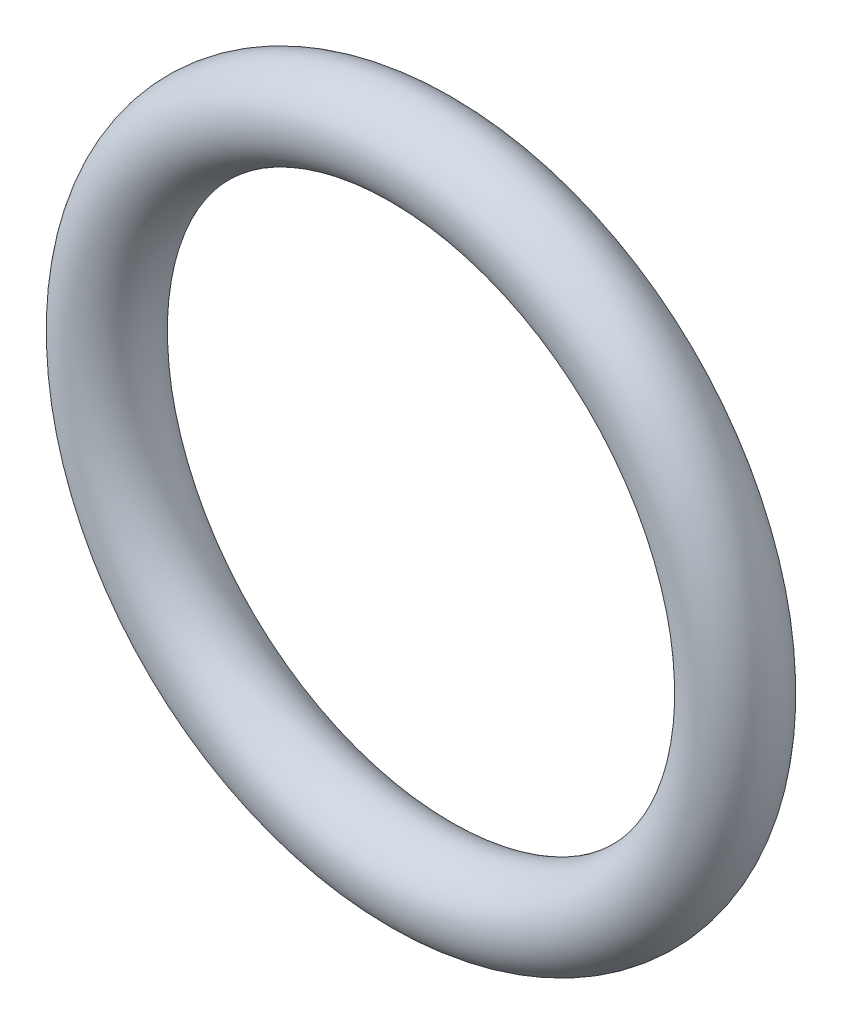
ISO-10303-21;
HEADER;
FILE_DESCRIPTION(('STEP AP214'),'2;1');
FILE_NAME('part.step','',(''),(''),'','','');
FILE_SCHEMA(('AUTOMOTIVE_DESIGN { 1 0 10303 214 1 1 1 1 }'));
ENDSEC;
DATA;
#1=APPLICATION_CONTEXT('core data for automotive mechanical design processes');
#2=APPLICATION_PROTOCOL_DEFINITION('international standard','automotive_design',2000,#1);
#3=PRODUCT_CONTEXT('',#1,'mechanical');
#4=PRODUCT('Part','Part','',(#3));
#5=PRODUCT_RELATED_PRODUCT_CATEGORY('part','',(#4));
#6=PRODUCT_DEFINITION_FORMATION('','',#4);
#7=PRODUCT_DEFINITION_CONTEXT('part definition',#1,'design');
#8=PRODUCT_DEFINITION('design','',#6,#7);
#9=PRODUCT_DEFINITION_SHAPE('','',#8);
#10=(LENGTH_UNIT() NAMED_UNIT(*) SI_UNIT(.MILLI.,.METRE.));
#11=(NAMED_UNIT(*) PLANE_ANGLE_UNIT() SI_UNIT($,.RADIAN.));
#12=(NAMED_UNIT(*) SI_UNIT($,.STERADIAN.) SOLID_ANGLE_UNIT());
#13=UNCERTAINTY_MEASURE_WITH_UNIT(LENGTH_MEASURE(1.E-05),#10,'distance_accuracy_value','');
#14=(GEOMETRIC_REPRESENTATION_CONTEXT(3) GLOBAL_UNCERTAINTY_ASSIGNED_CONTEXT((#13)) GLOBAL_UNIT_ASSIGNED_CONTEXT((#10,
#11,#12)) REPRESENTATION_CONTEXT('',''));
#15=CARTESIAN_POINT('',(0.,0.,0.));
#16=DIRECTION('',(0.,0.,1.));
#17=DIRECTION('',(1.,0.,0.));
#18=AXIS2_PLACEMENT_3D('',#15,#16,#17);
#19=CARTESIAN_POINT('',(0.,0.,0.));
#20=DIRECTION('',(0.,0.,1.));
#21=DIRECTION('',(1.,0.,0.));
#22=AXIS2_PLACEMENT_3D('',#19,#20,#21);
#23=TOROIDAL_SURFACE('',#22,17.4625,2.38125);
#24=CARTESIAN_POINT('',(0.,17.4625,0.));
#25=DIRECTION('',(1.,0.,0.));
#26=DIRECTION('',(0.,0.,-1.));
#27=AXIS2_PLACEMENT_3D('',#24,#25,#26);
#28=CIRCLE('',#27,2.38125);
#29=CARTESIAN_POINT('',(0.,19.84375,0.));
#30=VERTEX_POINT('',#29);
#31=EDGE_CURVE('E10',#30,#30,#28,.T.);
#32=CARTESIAN_POINT('',(0.,0.,0.));
#33=DIRECTION('',(0.,0.,1.));
#34=DIRECTION('',(1.,0.,0.));
#35=AXIS2_PLACEMENT_3D('',#32,#33,#34);
#36=CIRCLE('',#35,19.84375);
#37=EDGE_CURVE('',#30,#30,#36,.T.);
#38=ORIENTED_EDGE('',*,*,#31,.F.);
#39=ORIENTED_EDGE('',*,*,#31,.T.);
#40=ORIENTED_EDGE('',*,*,#37,.T.);
#41=ORIENTED_EDGE('',*,*,#37,.F.);
#42=EDGE_LOOP('',(#38,#40,#39,#41));
#43=FACE_BOUND('',#42,.T.);
#44=ADVANCED_FACE('F31',(#43),#23,.T.);
#45=CLOSED_SHELL('',(#44));
#46=MANIFOLD_SOLID_BREP('B2',#45);
#47=ADVANCED_BREP_SHAPE_REPRESENTATION('',(#18,#46),#14);
#48=SHAPE_DEFINITION_REPRESENTATION(#9,#47);
ENDSEC;
END-ISO-10303-21;
